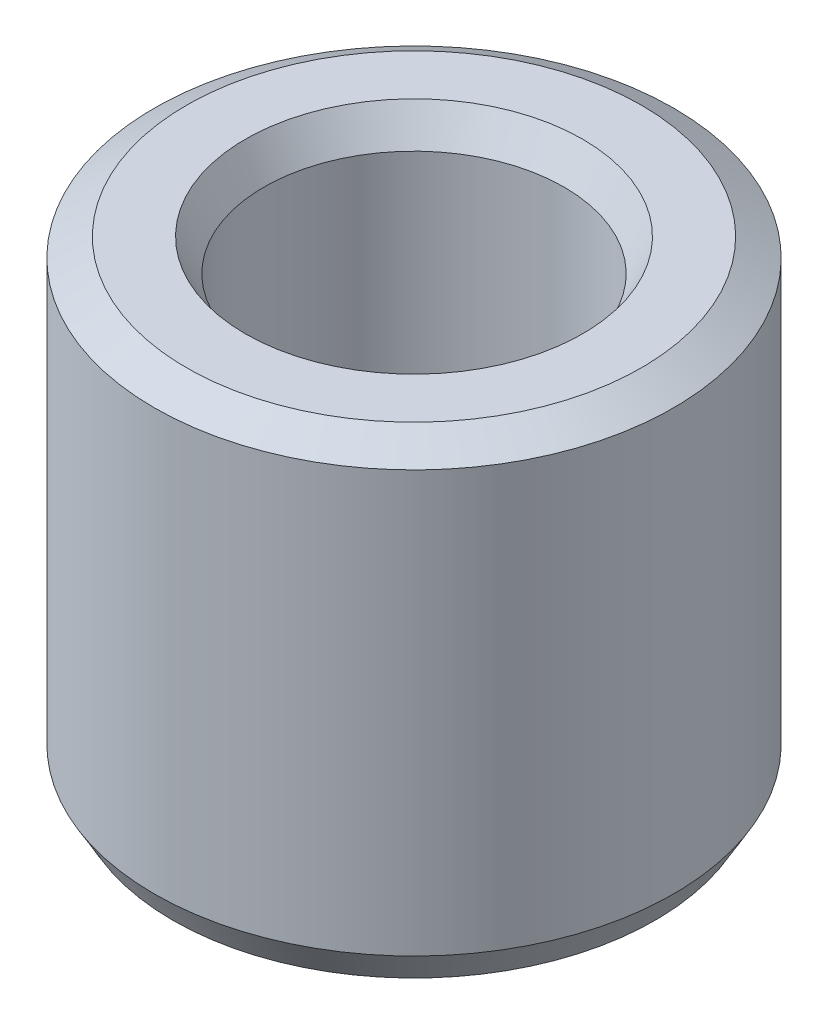
ISO-10303-21;
HEADER;
FILE_DESCRIPTION(('STEP AP214'),'2;1');
FILE_NAME('part.step','',(''),(''),'','','');
FILE_SCHEMA(('AUTOMOTIVE_DESIGN { 1 0 10303 214 1 1 1 1 }'));
ENDSEC;
DATA;
#1=APPLICATION_CONTEXT('core data for automotive mechanical design processes');
#2=APPLICATION_PROTOCOL_DEFINITION('international standard','automotive_design',2000,#1);
#3=PRODUCT_CONTEXT('',#1,'mechanical');
#4=PRODUCT('Part','Part','',(#3));
#5=PRODUCT_RELATED_PRODUCT_CATEGORY('part','',(#4));
#6=PRODUCT_DEFINITION_FORMATION('','',#4);
#7=PRODUCT_DEFINITION_CONTEXT('part definition',#1,'design');
#8=PRODUCT_DEFINITION('design','',#6,#7);
#9=PRODUCT_DEFINITION_SHAPE('','',#8);
#10=(LENGTH_UNIT() NAMED_UNIT(*) SI_UNIT(.MILLI.,.METRE.));
#11=(NAMED_UNIT(*) PLANE_ANGLE_UNIT() SI_UNIT($,.RADIAN.));
#12=(NAMED_UNIT(*) SI_UNIT($,.STERADIAN.) SOLID_ANGLE_UNIT());
#13=UNCERTAINTY_MEASURE_WITH_UNIT(LENGTH_MEASURE(1.E-05),#10,'distance_accuracy_value','');
#14=(GEOMETRIC_REPRESENTATION_CONTEXT(3) GLOBAL_UNCERTAINTY_ASSIGNED_CONTEXT((#13)) GLOBAL_UNIT_ASSIGNED_CONTEXT((#10,
#11,#12)) REPRESENTATION_CONTEXT('',''));
#15=CARTESIAN_POINT('',(0.,0.,0.));
#16=DIRECTION('',(0.,0.,1.));
#17=DIRECTION('',(1.,0.,0.));
#18=AXIS2_PLACEMENT_3D('',#15,#16,#17);
#19=CARTESIAN_POINT('',(0.,86.3136886476377,0.));
#20=DIRECTION('',(0.,-1.,0.));
#21=DIRECTION('',(0.,0.,-1.));
#22=AXIS2_PLACEMENT_3D('',#19,#20,#21);
#23=CYLINDRICAL_SURFACE('',#22,47.5);
#24=CARTESIAN_POINT('',(0.,5.888718904656,0.));
#25=DIRECTION('',(0.,1.,0.));
#26=DIRECTION('',(0.,0.,1.));
#27=AXIS2_PLACEMENT_3D('',#24,#25,#26);
#28=CIRCLE('',#27,47.5);
#29=CARTESIAN_POINT('',(0.,5.888718904656,47.5));
#30=VERTEX_POINT('',#29);
#31=EDGE_CURVE('E10',#30,#30,#28,.T.);
#32=ORIENTED_EDGE('',*,*,#31,.T.);
#33=EDGE_LOOP('',(#32));
#34=FACE_BOUND('',#33,.T.);
#35=CARTESIAN_POINT('',(0.,82.9138352028525,0.));
#36=DIRECTION('',(0.,1.,0.));
#37=DIRECTION('',(0.,0.,1.));
#38=AXIS2_PLACEMENT_3D('',#35,#36,#37);
#39=CIRCLE('',#38,47.5);
#40=CARTESIAN_POINT('',(0.,82.9138352028525,-47.5));
#41=VERTEX_POINT('',#40);
#42=EDGE_CURVE('E50',#41,#41,#39,.F.);
#43=ORIENTED_EDGE('',*,*,#42,.T.);
#44=EDGE_LOOP('',(#43));
#45=FACE_BOUND('',#44,.T.);
#46=ADVANCED_FACE('F39',(#34,#45),#23,.T.);
#47=CARTESIAN_POINT('',(0.,86.3136886476377,0.));
#48=DIRECTION('',(0.,1.,0.));
#49=DIRECTION('',(0.,0.,1.));
#50=AXIS2_PLACEMENT_3D('',#47,#48,#49);
#51=PLANE('',#50);
#52=CARTESIAN_POINT('',(0.,86.3136886476377,0.));
#53=DIRECTION('',(0.,1.,0.));
#54=DIRECTION('',(0.,0.,1.));
#55=AXIS2_PLACEMENT_3D('',#52,#53,#54);
#56=CIRCLE('',#55,30.8521746327699);
#57=CARTESIAN_POINT('',(0.,86.3136886476377,30.8521746327699));
#58=VERTEX_POINT('',#57);
#59=EDGE_CURVE('E58',#58,#58,#56,.F.);
#60=ORIENTED_EDGE('',*,*,#59,.T.);
#61=EDGE_LOOP('',(#60));
#62=FACE_BOUND('',#61,.T.);
#63=CARTESIAN_POINT('',(0.,86.3136886476377,0.));
#64=DIRECTION('',(0.,1.,0.));
#65=DIRECTION('',(0.,0.,1.));
#66=AXIS2_PLACEMENT_3D('',#63,#64,#65);
#67=CIRCLE('',#66,41.611281095344);
#68=CARTESIAN_POINT('',(0.,86.3136886476377,-41.611281095344));
#69=VERTEX_POINT('',#68);
#70=EDGE_CURVE('E61',#69,#69,#67,.T.);
#71=ORIENTED_EDGE('',*,*,#70,.T.);
#72=EDGE_LOOP('',(#71));
#73=FACE_BOUND('',#72,.T.);
#74=ADVANCED_FACE('F88',(#62,#73),#51,.T.);
#75=CARTESIAN_POINT('',(0.,0.,0.));
#76=DIRECTION('',(0.,1.,0.));
#77=DIRECTION('',(0.,0.,1.));
#78=AXIS2_PLACEMENT_3D('',#75,#76,#77);
#79=PLANE('',#78);
#80=CARTESIAN_POINT('',(0.,0.,0.));
#81=DIRECTION('',(0.,1.,0.));
#82=DIRECTION('',(0.,0.,1.));
#83=AXIS2_PLACEMENT_3D('',#80,#81,#82);
#84=CIRCLE('',#83,33.3410400926407);
#85=CARTESIAN_POINT('',(0.,0.,33.3410400926407));
#86=VERTEX_POINT('',#85);
#87=EDGE_CURVE('E51',#86,#86,#84,.T.);
#88=ORIENTED_EDGE('',*,*,#87,.T.);
#89=EDGE_LOOP('',(#88));
#90=FACE_BOUND('',#89,.T.);
#91=CARTESIAN_POINT('',(0.,0.,0.));
#92=DIRECTION('',(0.,1.,0.));
#93=DIRECTION('',(0.,0.,1.));
#94=AXIS2_PLACEMENT_3D('',#91,#92,#93);
#95=CIRCLE('',#94,44.1001465552148);
#96=CARTESIAN_POINT('',(0.,0.,44.1001465552148));
#97=VERTEX_POINT('',#96);
#98=EDGE_CURVE('E54',#97,#97,#95,.F.);
#99=ORIENTED_EDGE('',*,*,#98,.T.);
#100=EDGE_LOOP('',(#99));
#101=FACE_BOUND('',#100,.T.);
#102=ADVANCED_FACE('F83',(#90,#101),#79,.F.);
#103=CARTESIAN_POINT('',(0.,86.3136886476377,0.));
#104=DIRECTION('',(0.,-1.,0.));
#105=DIRECTION('',(0.,0.,-1.));
#106=AXIS2_PLACEMENT_3D('',#103,#104,#105);
#107=CYLINDRICAL_SURFACE('',#106,27.4523211879847);
#108=CARTESIAN_POINT('',(0.,80.4249697429817,0.));
#109=DIRECTION('',(0.,1.,0.));
#110=DIRECTION('',(0.,0.,1.));
#111=AXIS2_PLACEMENT_3D('',#108,#109,#110);
#112=CIRCLE('',#111,27.4523211879847);
#113=CARTESIAN_POINT('',(0.,80.4249697429817,27.4523211879847));
#114=VERTEX_POINT('',#113);
#115=EDGE_CURVE('E67',#114,#114,#112,.T.);
#116=ORIENTED_EDGE('',*,*,#115,.T.);
#117=EDGE_LOOP('',(#116));
#118=FACE_BOUND('',#117,.T.);
#119=CARTESIAN_POINT('',(0.,3.39985344478523,0.));
#120=DIRECTION('',(0.,1.,0.));
#121=DIRECTION('',(0.,0.,1.));
#122=AXIS2_PLACEMENT_3D('',#119,#120,#121);
#123=CIRCLE('',#122,27.4523211879847);
#124=CARTESIAN_POINT('',(0.,3.39985344478523,27.4523211879847));
#125=VERTEX_POINT('',#124);
#126=EDGE_CURVE('E69',#125,#125,#123,.F.);
#127=ORIENTED_EDGE('',*,*,#126,.T.);
#128=EDGE_LOOP('',(#127));
#129=FACE_BOUND('',#128,.T.);
#130=ADVANCED_FACE('F71',(#118,#129),#107,.F.);
#131=CARTESIAN_POINT('',(0.,80.4249697429817,0.));
#132=DIRECTION('',(0.,1.,0.));
#133=DIRECTION('',(0.,0.,1.));
#134=AXIS2_PLACEMENT_3D('',#131,#132,#133);
#135=CONICAL_SURFACE('',#134,27.4523211879847,0.523598775598303);
#136=ORIENTED_EDGE('',*,*,#59,.F.);
#137=EDGE_LOOP('',(#136));
#138=FACE_BOUND('',#137,.T.);
#139=ORIENTED_EDGE('',*,*,#115,.F.);
#140=EDGE_LOOP('',(#139));
#141=FACE_BOUND('',#140,.T.);
#142=ADVANCED_FACE('F77',(#138,#141),#135,.F.);
#143=CARTESIAN_POINT('',(0.,0.,0.));
#144=DIRECTION('',(0.,-1.,0.));
#145=DIRECTION('',(0.,0.,-1.));
#146=AXIS2_PLACEMENT_3D('',#143,#144,#145);
#147=CONICAL_SURFACE('',#146,33.3410400926407,1.04719755119659);
#148=ORIENTED_EDGE('',*,*,#126,.F.);
#149=EDGE_LOOP('',(#148));
#150=FACE_BOUND('',#149,.T.);
#151=ORIENTED_EDGE('',*,*,#87,.F.);
#152=EDGE_LOOP('',(#151));
#153=FACE_BOUND('',#152,.T.);
#154=ADVANCED_FACE('F73',(#150,#153),#147,.F.);
#155=CARTESIAN_POINT('',(0.,5.888718904656,0.));
#156=DIRECTION('',(0.,1.,0.));
#157=DIRECTION('',(0.,0.,1.));
#158=AXIS2_PLACEMENT_3D('',#155,#156,#157);
#159=CONICAL_SURFACE('',#158,47.5,0.523598775598302);
#160=ORIENTED_EDGE('',*,*,#98,.F.);
#161=EDGE_LOOP('',(#160));
#162=FACE_BOUND('',#161,.T.);
#163=ORIENTED_EDGE('',*,*,#31,.F.);
#164=EDGE_LOOP('',(#163));
#165=FACE_BOUND('',#164,.T.);
#166=ADVANCED_FACE('F76',(#162,#165),#159,.T.);
#167=CARTESIAN_POINT('',(0.,86.3136886476377,0.));
#168=DIRECTION('',(0.,-1.,0.));
#169=DIRECTION('',(0.,0.,-1.));
#170=AXIS2_PLACEMENT_3D('',#167,#168,#169);
#171=CONICAL_SURFACE('',#170,41.611281095344,1.04719755119659);
#172=CARTESIAN_POINT('',(0.,82.9138352028525,-47.5));
#173=CARTESIAN_POINT('',(0.,82.9492503429023,-47.4386591780765));
#174=CARTESIAN_POINT('',(0.,82.9846654829522,-47.377318356153));
#175=CARTESIAN_POINT('',(0.,83.0554957630519,-47.254636712306));
#176=CARTESIAN_POINT('',(0.,83.0909109031017,-47.1932958903825));
#177=CARTESIAN_POINT('',(0.,83.1617411832014,-47.0706142465355));
#178=CARTESIAN_POINT('',(0.,83.1971563232513,-47.009273424612));
#179=CARTESIAN_POINT('',(0.,83.2679866033509,-46.886591780765));
#180=CARTESIAN_POINT('',(0.,83.3034017434008,-46.8252509588415));
#181=CARTESIAN_POINT('',(0.,83.3742320235005,-46.7025693149945));
#182=CARTESIAN_POINT('',(0.,83.4096471635503,-46.641228493071));
#183=CARTESIAN_POINT('',(0.,83.48047744365,-46.518546849224));
#184=CARTESIAN_POINT('',(0.,83.5158925836999,-46.4572060273005));
#185=CARTESIAN_POINT('',(0.,83.5867228637996,-46.3345243834535));
#186=CARTESIAN_POINT('',(0.,83.6221380038494,-46.27318356153));
#187=CARTESIAN_POINT('',(0.,83.6929682839491,-46.150501917683));
#188=CARTESIAN_POINT('',(0.,83.728383423999,-46.0891610957595));
#189=CARTESIAN_POINT('',(0.,83.7992137040986,-45.9664794519125));
#190=CARTESIAN_POINT('',(0.,83.8346288441485,-45.905138629989));
#191=CARTESIAN_POINT('',(0.,83.9054591242482,-45.782456986142));
#192=CARTESIAN_POINT('',(0.,83.940874264298,-45.7211161642185));
#193=CARTESIAN_POINT('',(0.,84.0117045443977,-45.5984345203715));
#194=CARTESIAN_POINT('',(0.,84.0471196844476,-45.537093698448));
#195=CARTESIAN_POINT('',(0.,84.1179499645473,-45.414412054601));
#196=CARTESIAN_POINT('',(0.,84.1533651045971,-45.3530712326775));
#197=CARTESIAN_POINT('',(0.,84.2241953846968,-45.2303895888305));
#198=CARTESIAN_POINT('',(0.,84.2596105247467,-45.169048766907));
#199=CARTESIAN_POINT('',(0.,84.3304408048463,-45.04636712306));
#200=CARTESIAN_POINT('',(0.,84.3658559448962,-44.9850263011365));
#201=CARTESIAN_POINT('',(0.,84.4366862249959,-44.8623446572895));
#202=CARTESIAN_POINT('',(0.,84.4721013650457,-44.801003835366));
#203=CARTESIAN_POINT('',(0.,84.5429316451454,-44.678322191519));
#204=CARTESIAN_POINT('',(0.,84.5783467851953,-44.6169813695955));
#205=CARTESIAN_POINT('',(0.,84.6491770652949,-44.4942997257485));
#206=CARTESIAN_POINT('',(0.,84.6845922053448,-44.432958903825));
#207=CARTESIAN_POINT('',(0.,84.7554224854445,-44.310277259978));
#208=CARTESIAN_POINT('',(0.,84.7908376254944,-44.2489364380545));
#209=CARTESIAN_POINT('',(0.,84.861667905594,-44.1262547942075));
#210=CARTESIAN_POINT('',(0.,84.8970830456439,-44.064913972284));
#211=CARTESIAN_POINT('',(0.,84.9679133257436,-43.942232328437));
#212=CARTESIAN_POINT('',(0.,85.0033284657934,-43.8808915065135));
#213=CARTESIAN_POINT('',(0.,85.0741587458931,-43.7582098626665));
#214=CARTESIAN_POINT('',(0.,85.109573885943,-43.696869040743));
#215=CARTESIAN_POINT('',(0.,85.1804041660426,-43.574187396896));
#216=CARTESIAN_POINT('',(0.,85.2158193060925,-43.5128465749725));
#217=CARTESIAN_POINT('',(0.,85.2866495861922,-43.3901649311255));
#218=CARTESIAN_POINT('',(0.,85.322064726242,-43.328824109202));
#219=CARTESIAN_POINT('',(0.,85.3928950063417,-43.206142465355));
#220=CARTESIAN_POINT('',(0.,85.4283101463916,-43.1448016434315));
#221=CARTESIAN_POINT('',(0.,85.4991404264913,-43.0221199995845));
#222=CARTESIAN_POINT('',(0.,85.5345555665411,-42.960779177661));
#223=CARTESIAN_POINT('',(0.,85.6053858466408,-42.838097533814));
#224=CARTESIAN_POINT('',(0.,85.6408009866907,-42.7767567118905));
#225=CARTESIAN_POINT('',(0.,85.7116312667903,-42.6540750680435));
#226=CARTESIAN_POINT('',(0.,85.7470464068402,-42.59273424612));
#227=CARTESIAN_POINT('',(0.,85.8178766869399,-42.470052602273));
#228=CARTESIAN_POINT('',(0.,85.8532918269897,-42.4087117803495));
#229=CARTESIAN_POINT('',(0.,85.9241221070894,-42.2860301365025));
#230=CARTESIAN_POINT('',(0.,85.9595372471393,-42.224689314579));
#231=CARTESIAN_POINT('',(0.,86.030367527239,-42.102007670732));
#232=CARTESIAN_POINT('',(0.,86.0657826672888,-42.0406668488085));
#233=CARTESIAN_POINT('',(0.,86.1366129473885,-41.9179852049615));
#234=CARTESIAN_POINT('',(0.,86.1720280874384,-41.856644383038));
#235=CARTESIAN_POINT('',(0.,86.242858367538,-41.733962739191));
#236=CARTESIAN_POINT('',(0.,86.2782735075879,-41.6726219172675));
#237=CARTESIAN_POINT('',(0.,86.3136886476377,-41.611281095344));
#238=B_SPLINE_CURVE_WITH_KNOTS('',3,(#172,#173,#174,#175,#176,#177,#178,#179,#180,#181,#182,
#183,#184,#185,#186,#187,#188,#189,#190,#191,#192,#193,#194,#195,#196,#197,#198,#199,#200,#201,
#202,#203,#204,#205,#206,#207,#208,#209,#210,#211,#212,#213,#214,#215,#216,#217,#218,#219,#220,
#221,#222,#223,#224,#225,#226,#227,#228,#229,#230,#231,#232,#233,#234,#235,#236,#237),
.UNSPECIFIED.,.F.,.F.,(4,2,2,2,2,2,2,2,2,2,2,2,2,2,2,2,2,2,2,2,2,2,2,2,2,2,2,2,2,2,2,2,4),(0.,
0.212490840299082,0.424981680598157,0.637472520897232,0.849963361196308,1.06245420149538,
1.27494504179446,1.48743588209353,1.69992672239261,1.91241756269169,2.12490840299076,
2.33739924328985,2.54989008358892,2.762380923888,2.97487176418707,3.18736260448615,
3.39985344478522,3.6123442850843,3.82483512538338,4.03732596568245,4.24981680598153,
4.4623076462806,4.67479848657968,4.88728932687875,5.09978016717784,5.31227100747691,
5.52476184777599,5.73725268807506,5.94974352837414,6.16223436867321,6.37472520897229,
6.58721604927137,6.79970688957044),.UNSPECIFIED.);
#239=EDGE_CURVE('BSEAM45',#41,#69,#238,.T.);
#240=ORIENTED_EDGE('',*,*,#42,.F.);
#241=ORIENTED_EDGE('',*,*,#70,.F.);
#242=ORIENTED_EDGE('',*,*,#239,.T.);
#243=ORIENTED_EDGE('',*,*,#239,.F.);
#244=EDGE_LOOP('',(#240,#242,#241,#243));
#245=FACE_BOUND('',#244,.T.);
#246=ADVANCED_FACE('F45',(#245),#171,.T.);
#247=CLOSED_SHELL('',(#46,#74,#102,#130,#142,#154,#166,#246));
#248=MANIFOLD_SOLID_BREP('B2',#247);
#249=ADVANCED_BREP_SHAPE_REPRESENTATION('',(#18,#248),#14);
#250=SHAPE_DEFINITION_REPRESENTATION(#9,#249);
ENDSEC;
END-ISO-10303-21;
